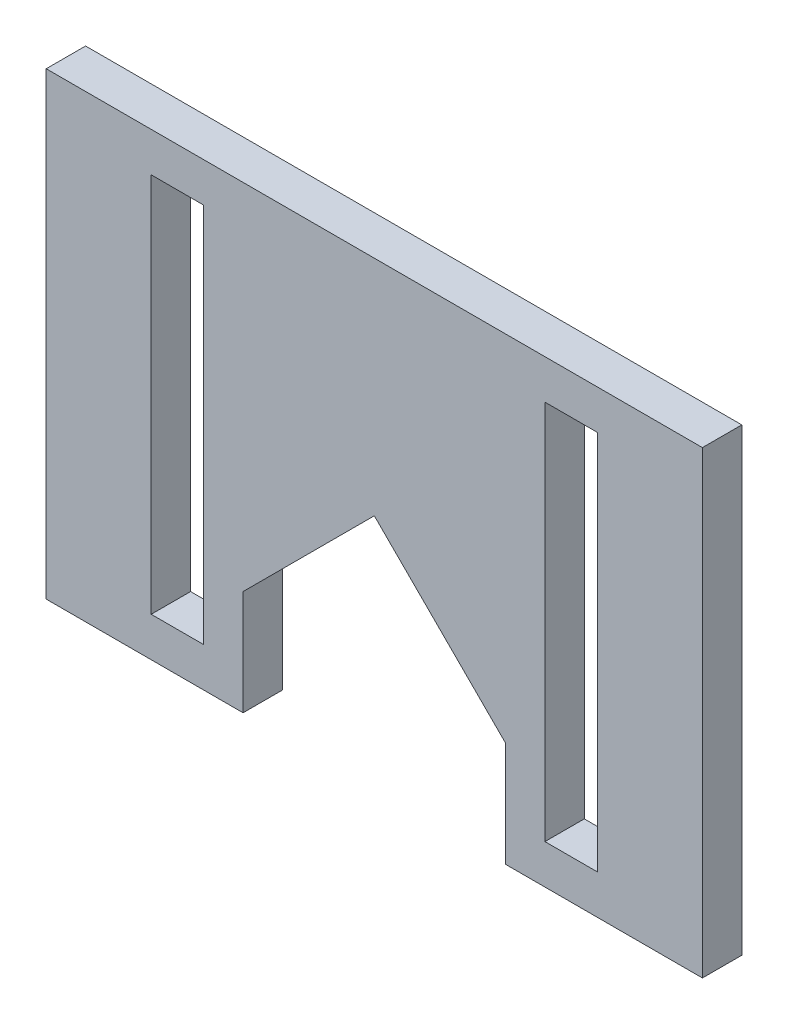
ISO-10303-21;
HEADER;
FILE_DESCRIPTION(('STEP AP214'),'2;1');
FILE_NAME('part.step','',(''),(''),'','','');
FILE_SCHEMA(('AUTOMOTIVE_DESIGN { 1 0 10303 214 1 1 1 1 }'));
ENDSEC;
DATA;
#1=APPLICATION_CONTEXT('core data for automotive mechanical design processes');
#2=APPLICATION_PROTOCOL_DEFINITION('international standard','automotive_design',2000,#1);
#3=PRODUCT_CONTEXT('',#1,'mechanical');
#4=PRODUCT('Part','Part','',(#3));
#5=PRODUCT_RELATED_PRODUCT_CATEGORY('part','',(#4));
#6=PRODUCT_DEFINITION_FORMATION('','',#4);
#7=PRODUCT_DEFINITION_CONTEXT('part definition',#1,'design');
#8=PRODUCT_DEFINITION('design','',#6,#7);
#9=PRODUCT_DEFINITION_SHAPE('','',#8);
#10=(LENGTH_UNIT() NAMED_UNIT(*) SI_UNIT(.MILLI.,.METRE.));
#11=(NAMED_UNIT(*) PLANE_ANGLE_UNIT() SI_UNIT($,.RADIAN.));
#12=(NAMED_UNIT(*) SI_UNIT($,.STERADIAN.) SOLID_ANGLE_UNIT());
#13=UNCERTAINTY_MEASURE_WITH_UNIT(LENGTH_MEASURE(1.E-05),#10,'distance_accuracy_value','');
#14=(GEOMETRIC_REPRESENTATION_CONTEXT(3) GLOBAL_UNCERTAINTY_ASSIGNED_CONTEXT((#13)) GLOBAL_UNIT_ASSIGNED_CONTEXT((#10,
#11,#12)) REPRESENTATION_CONTEXT('',''));
#15=CARTESIAN_POINT('',(0.,0.,0.));
#16=DIRECTION('',(0.,0.,1.));
#17=DIRECTION('',(1.,0.,0.));
#18=AXIS2_PLACEMENT_3D('',#15,#16,#17);
#19=CARTESIAN_POINT('',(0.,0.,3.));
#20=DIRECTION('',(0.,0.,1.));
#21=DIRECTION('',(1.,0.,0.));
#22=AXIS2_PLACEMENT_3D('',#19,#20,#21);
#23=PLANE('',#22);
#24=DIRECTION('',(1.,0.,0.));
#25=VECTOR('',#24,1.);
#26=CARTESIAN_POINT('',(-42.,2.99999999999999,3.));
#27=LINE('',#26,#25);
#28=CARTESIAN_POINT('',(-42.,2.99999999999999,3.));
#29=VERTEX_POINT('',#28);
#30=CARTESIAN_POINT('',(-38.,2.99999999999999,3.));
#31=VERTEX_POINT('',#30);
#32=EDGE_CURVE('E194',#29,#31,#27,.T.);
#33=ORIENTED_EDGE('',*,*,#32,.F.);
#34=DIRECTION('',(0.,-1.,0.));
#35=VECTOR('',#34,1.);
#36=CARTESIAN_POINT('',(-42.,32.,3.));
#37=LINE('',#36,#35);
#38=CARTESIAN_POINT('',(-42.,32.,3.));
#39=VERTEX_POINT('',#38);
#40=EDGE_CURVE('E192',#39,#29,#37,.T.);
#41=ORIENTED_EDGE('',*,*,#40,.F.);
#42=DIRECTION('',(-1.,0.,0.));
#43=VECTOR('',#42,1.);
#44=CARTESIAN_POINT('',(-42.,32.,3.));
#45=LINE('',#44,#43);
#46=CARTESIAN_POINT('',(-38.,32.,3.));
#47=VERTEX_POINT('',#46);
#48=EDGE_CURVE('E200',#47,#39,#45,.T.);
#49=ORIENTED_EDGE('',*,*,#48,.F.);
#50=DIRECTION('',(0.,1.,0.));
#51=VECTOR('',#50,1.);
#52=CARTESIAN_POINT('',(-38.,32.,3.));
#53=LINE('',#52,#51);
#54=EDGE_CURVE('E197',#31,#47,#53,.T.);
#55=ORIENTED_EDGE('',*,*,#54,.F.);
#56=EDGE_LOOP('',(#33,#41,#49,#55));
#57=FACE_BOUND('',#56,.T.);
#58=DIRECTION('',(0.,1.,0.));
#59=VECTOR('',#58,1.);
#60=CARTESIAN_POINT('',(0.,0.,3.));
#61=LINE('',#60,#59);
#62=CARTESIAN_POINT('',(0.,0.,3.));
#63=VERTEX_POINT('',#62);
#64=CARTESIAN_POINT('',(0.,35.,3.));
#65=VERTEX_POINT('',#64);
#66=EDGE_CURVE('E223',#63,#65,#61,.T.);
#67=ORIENTED_EDGE('',*,*,#66,.T.);
#68=DIRECTION('',(-1.,0.,0.));
#69=VECTOR('',#68,1.);
#70=CARTESIAN_POINT('',(0.,35.,3.));
#71=LINE('',#70,#69);
#72=CARTESIAN_POINT('',(-50.,35.,3.));
#73=VERTEX_POINT('',#72);
#74=EDGE_CURVE('E226',#65,#73,#71,.T.);
#75=ORIENTED_EDGE('',*,*,#74,.T.);
#76=DIRECTION('',(0.,-1.,0.));
#77=VECTOR('',#76,1.);
#78=CARTESIAN_POINT('',(-50.,0.,3.));
#79=LINE('',#78,#77);
#80=CARTESIAN_POINT('',(-50.,0.,3.));
#81=VERTEX_POINT('',#80);
#82=EDGE_CURVE('E229',#73,#81,#79,.T.);
#83=ORIENTED_EDGE('',*,*,#82,.T.);
#84=DIRECTION('',(1.,0.,0.));
#85=VECTOR('',#84,1.);
#86=CARTESIAN_POINT('',(-35.,0.,3.));
#87=LINE('',#86,#85);
#88=CARTESIAN_POINT('',(-35.,0.,3.));
#89=VERTEX_POINT('',#88);
#90=EDGE_CURVE('E231',#81,#89,#87,.T.);
#91=ORIENTED_EDGE('',*,*,#90,.T.);
#92=DIRECTION('',(0.,1.,0.));
#93=VECTOR('',#92,1.);
#94=CARTESIAN_POINT('',(-35.,0.,3.));
#95=LINE('',#94,#93);
#96=CARTESIAN_POINT('',(-35.,8.,3.));
#97=VERTEX_POINT('',#96);
#98=EDGE_CURVE('E233',#89,#97,#95,.T.);
#99=ORIENTED_EDGE('',*,*,#98,.T.);
#100=DIRECTION('',(0.707106781186546,0.707106781186549,0.));
#101=VECTOR('',#100,1.);
#102=CARTESIAN_POINT('',(-35.,8.,3.));
#103=LINE('',#102,#101);
#104=CARTESIAN_POINT('',(-25.,18.,3.));
#105=VERTEX_POINT('',#104);
#106=EDGE_CURVE('E235',#97,#105,#103,.T.);
#107=ORIENTED_EDGE('',*,*,#106,.T.);
#108=DIRECTION('',(0.707106781186546,-0.707106781186549,0.));
#109=VECTOR('',#108,1.);
#110=CARTESIAN_POINT('',(-25.,18.,3.));
#111=LINE('',#110,#109);
#112=CARTESIAN_POINT('',(-15.,8.,3.));
#113=VERTEX_POINT('',#112);
#114=EDGE_CURVE('E237',#105,#113,#111,.T.);
#115=ORIENTED_EDGE('',*,*,#114,.T.);
#116=DIRECTION('',(0.,-1.,0.));
#117=VECTOR('',#116,1.);
#118=CARTESIAN_POINT('',(-15.,8.,3.));
#119=LINE('',#118,#117);
#120=CARTESIAN_POINT('',(-15.,0.,3.));
#121=VERTEX_POINT('',#120);
#122=EDGE_CURVE('E239',#113,#121,#119,.T.);
#123=ORIENTED_EDGE('',*,*,#122,.T.);
#124=DIRECTION('',(1.,0.,0.));
#125=VECTOR('',#124,1.);
#126=CARTESIAN_POINT('',(0.,0.,3.));
#127=LINE('',#126,#125);
#128=EDGE_CURVE('E241',#121,#63,#127,.T.);
#129=ORIENTED_EDGE('',*,*,#128,.T.);
#130=EDGE_LOOP('',(#67,#75,#83,#91,#99,#107,#115,#123,#129));
#131=FACE_BOUND('',#130,.T.);
#132=DIRECTION('',(1.,0.,0.));
#133=VECTOR('',#132,1.);
#134=CARTESIAN_POINT('',(-12.,3.,3.));
#135=LINE('',#134,#133);
#136=CARTESIAN_POINT('',(-12.,3.,3.));
#137=VERTEX_POINT('',#136);
#138=CARTESIAN_POINT('',(-8.,3.,3.));
#139=VERTEX_POINT('',#138);
#140=EDGE_CURVE('E164',#137,#139,#135,.T.);
#141=ORIENTED_EDGE('',*,*,#140,.F.);
#142=DIRECTION('',(0.,-1.,0.));
#143=VECTOR('',#142,1.);
#144=CARTESIAN_POINT('',(-12.,32.,3.));
#145=LINE('',#144,#143);
#146=CARTESIAN_POINT('',(-12.,32.,3.));
#147=VERTEX_POINT('',#146);
#148=EDGE_CURVE('E156',#147,#137,#145,.T.);
#149=ORIENTED_EDGE('',*,*,#148,.F.);
#150=DIRECTION('',(-1.,0.,0.));
#151=VECTOR('',#150,1.);
#152=CARTESIAN_POINT('',(-12.,32.,3.));
#153=LINE('',#152,#151);
#154=CARTESIAN_POINT('',(-8.,32.,3.));
#155=VERTEX_POINT('',#154);
#156=EDGE_CURVE('E178',#155,#147,#153,.T.);
#157=ORIENTED_EDGE('',*,*,#156,.F.);
#158=DIRECTION('',(0.,1.,0.));
#159=VECTOR('',#158,1.);
#160=CARTESIAN_POINT('',(-8.,32.,3.));
#161=LINE('',#160,#159);
#162=EDGE_CURVE('E176',#139,#155,#161,.T.);
#163=ORIENTED_EDGE('',*,*,#162,.F.);
#164=EDGE_LOOP('',(#141,#149,#157,#163));
#165=FACE_BOUND('',#164,.T.);
#166=ADVANCED_FACE('F37',(#57,#131,#165),#23,.T.);
#167=CARTESIAN_POINT('',(0.,0.,0.));
#168=DIRECTION('',(0.,0.,1.));
#169=DIRECTION('',(1.,0.,0.));
#170=AXIS2_PLACEMENT_3D('',#167,#168,#169);
#171=PLANE('',#170);
#172=DIRECTION('',(0.,-1.,0.));
#173=VECTOR('',#172,1.);
#174=CARTESIAN_POINT('',(-42.,32.,0.));
#175=LINE('',#174,#173);
#176=CARTESIAN_POINT('',(-42.,32.,0.));
#177=VERTEX_POINT('',#176);
#178=CARTESIAN_POINT('',(-42.,2.99999999999999,0.));
#179=VERTEX_POINT('',#178);
#180=EDGE_CURVE('E172',#177,#179,#175,.T.);
#181=ORIENTED_EDGE('',*,*,#180,.T.);
#182=DIRECTION('',(1.,0.,0.));
#183=VECTOR('',#182,1.);
#184=CARTESIAN_POINT('',(-42.,2.99999999999999,0.));
#185=LINE('',#184,#183);
#186=CARTESIAN_POINT('',(-38.,2.99999999999999,0.));
#187=VERTEX_POINT('',#186);
#188=EDGE_CURVE('E205',#179,#187,#185,.T.);
#189=ORIENTED_EDGE('',*,*,#188,.T.);
#190=DIRECTION('',(0.,1.,0.));
#191=VECTOR('',#190,1.);
#192=CARTESIAN_POINT('',(-38.,32.,0.));
#193=LINE('',#192,#191);
#194=CARTESIAN_POINT('',(-38.,32.,0.));
#195=VERTEX_POINT('',#194);
#196=EDGE_CURVE('E208',#187,#195,#193,.T.);
#197=ORIENTED_EDGE('',*,*,#196,.T.);
#198=DIRECTION('',(-1.,0.,0.));
#199=VECTOR('',#198,1.);
#200=CARTESIAN_POINT('',(-42.,32.,0.));
#201=LINE('',#200,#199);
#202=EDGE_CURVE('E195',#195,#177,#201,.T.);
#203=ORIENTED_EDGE('',*,*,#202,.T.);
#204=EDGE_LOOP('',(#181,#189,#197,#203));
#205=FACE_BOUND('',#204,.T.);
#206=DIRECTION('',(0.,1.,0.));
#207=VECTOR('',#206,1.);
#208=CARTESIAN_POINT('',(0.,0.,0.));
#209=LINE('',#208,#207);
#210=CARTESIAN_POINT('',(0.,0.,0.));
#211=VERTEX_POINT('',#210);
#212=CARTESIAN_POINT('',(0.,35.,0.));
#213=VERTEX_POINT('',#212);
#214=EDGE_CURVE('E222',#211,#213,#209,.T.);
#215=ORIENTED_EDGE('',*,*,#214,.F.);
#216=DIRECTION('',(1.,0.,0.));
#217=VECTOR('',#216,1.);
#218=CARTESIAN_POINT('',(0.,0.,0.));
#219=LINE('',#218,#217);
#220=CARTESIAN_POINT('',(-15.,0.,0.));
#221=VERTEX_POINT('',#220);
#222=EDGE_CURVE('E227',#221,#211,#219,.T.);
#223=ORIENTED_EDGE('',*,*,#222,.F.);
#224=DIRECTION('',(0.,-1.,0.));
#225=VECTOR('',#224,1.);
#226=CARTESIAN_POINT('',(-15.,8.,0.));
#227=LINE('',#226,#225);
#228=CARTESIAN_POINT('',(-15.,8.,0.));
#229=VERTEX_POINT('',#228);
#230=EDGE_CURVE('E258',#229,#221,#227,.T.);
#231=ORIENTED_EDGE('',*,*,#230,.F.);
#232=DIRECTION('',(0.707106781186546,-0.707106781186549,0.));
#233=VECTOR('',#232,1.);
#234=CARTESIAN_POINT('',(-25.,18.,0.));
#235=LINE('',#234,#233);
#236=CARTESIAN_POINT('',(-25.,18.,0.));
#237=VERTEX_POINT('',#236);
#238=EDGE_CURVE('E256',#237,#229,#235,.T.);
#239=ORIENTED_EDGE('',*,*,#238,.F.);
#240=DIRECTION('',(0.707106781186546,0.707106781186549,0.));
#241=VECTOR('',#240,1.);
#242=CARTESIAN_POINT('',(-35.,8.,0.));
#243=LINE('',#242,#241);
#244=CARTESIAN_POINT('',(-35.,8.,0.));
#245=VERTEX_POINT('',#244);
#246=EDGE_CURVE('E254',#245,#237,#243,.T.);
#247=ORIENTED_EDGE('',*,*,#246,.F.);
#248=DIRECTION('',(0.,1.,0.));
#249=VECTOR('',#248,1.);
#250=CARTESIAN_POINT('',(-35.,0.,0.));
#251=LINE('',#250,#249);
#252=CARTESIAN_POINT('',(-35.,0.,0.));
#253=VERTEX_POINT('',#252);
#254=EDGE_CURVE('E252',#253,#245,#251,.T.);
#255=ORIENTED_EDGE('',*,*,#254,.F.);
#256=DIRECTION('',(1.,0.,0.));
#257=VECTOR('',#256,1.);
#258=CARTESIAN_POINT('',(-35.,0.,0.));
#259=LINE('',#258,#257);
#260=CARTESIAN_POINT('',(-50.,0.,0.));
#261=VERTEX_POINT('',#260);
#262=EDGE_CURVE('E250',#261,#253,#259,.T.);
#263=ORIENTED_EDGE('',*,*,#262,.F.);
#264=DIRECTION('',(0.,-1.,0.));
#265=VECTOR('',#264,1.);
#266=CARTESIAN_POINT('',(-50.,0.,0.));
#267=LINE('',#266,#265);
#268=CARTESIAN_POINT('',(-50.,35.,0.));
#269=VERTEX_POINT('',#268);
#270=EDGE_CURVE('E248',#269,#261,#267,.T.);
#271=ORIENTED_EDGE('',*,*,#270,.F.);
#272=DIRECTION('',(-1.,0.,0.));
#273=VECTOR('',#272,1.);
#274=CARTESIAN_POINT('',(0.,35.,0.));
#275=LINE('',#274,#273);
#276=EDGE_CURVE('E246',#213,#269,#275,.T.);
#277=ORIENTED_EDGE('',*,*,#276,.F.);
#278=EDGE_LOOP('',(#215,#223,#231,#239,#247,#255,#263,#271,#277));
#279=FACE_BOUND('',#278,.T.);
#280=DIRECTION('',(0.,-1.,0.));
#281=VECTOR('',#280,1.);
#282=CARTESIAN_POINT('',(-12.,32.,0.));
#283=LINE('',#282,#281);
#284=CARTESIAN_POINT('',(-12.,32.,0.));
#285=VERTEX_POINT('',#284);
#286=CARTESIAN_POINT('',(-12.,3.,0.));
#287=VERTEX_POINT('',#286);
#288=EDGE_CURVE('E60',#285,#287,#283,.T.);
#289=ORIENTED_EDGE('',*,*,#288,.T.);
#290=DIRECTION('',(1.,0.,0.));
#291=VECTOR('',#290,1.);
#292=CARTESIAN_POINT('',(-12.,3.,0.));
#293=LINE('',#292,#291);
#294=CARTESIAN_POINT('',(-8.,3.,0.));
#295=VERTEX_POINT('',#294);
#296=EDGE_CURVE('E171',#287,#295,#293,.T.);
#297=ORIENTED_EDGE('',*,*,#296,.T.);
#298=DIRECTION('',(0.,1.,0.));
#299=VECTOR('',#298,1.);
#300=CARTESIAN_POINT('',(-8.,32.,0.));
#301=LINE('',#300,#299);
#302=CARTESIAN_POINT('',(-8.,32.,0.));
#303=VERTEX_POINT('',#302);
#304=EDGE_CURVE('E184',#295,#303,#301,.T.);
#305=ORIENTED_EDGE('',*,*,#304,.T.);
#306=DIRECTION('',(-1.,0.,0.));
#307=VECTOR('',#306,1.);
#308=CARTESIAN_POINT('',(-12.,32.,0.));
#309=LINE('',#308,#307);
#310=EDGE_CURVE('E165',#303,#285,#309,.T.);
#311=ORIENTED_EDGE('',*,*,#310,.T.);
#312=EDGE_LOOP('',(#289,#297,#305,#311));
#313=FACE_BOUND('',#312,.T.);
#314=ADVANCED_FACE('F291',(#205,#279,#313),#171,.F.);
#315=CARTESIAN_POINT('',(0.,0.,3.));
#316=DIRECTION('',(-1.,0.,0.));
#317=DIRECTION('',(0.,0.,1.));
#318=AXIS2_PLACEMENT_3D('',#315,#316,#317);
#319=PLANE('',#318);
#320=ORIENTED_EDGE('',*,*,#214,.T.);
#321=DIRECTION('',(0.,0.,-1.));
#322=VECTOR('',#321,1.);
#323=CARTESIAN_POINT('',(0.,35.,3.));
#324=LINE('',#323,#322);
#325=EDGE_CURVE('E11',#65,#213,#324,.T.);
#326=ORIENTED_EDGE('',*,*,#325,.F.);
#327=ORIENTED_EDGE('',*,*,#66,.F.);
#328=DIRECTION('',(0.,0.,-1.));
#329=VECTOR('',#328,1.);
#330=CARTESIAN_POINT('',(0.,0.,3.));
#331=LINE('',#330,#329);
#332=EDGE_CURVE('E243',#63,#211,#331,.T.);
#333=ORIENTED_EDGE('',*,*,#332,.T.);
#334=EDGE_LOOP('',(#320,#326,#327,#333));
#335=FACE_BOUND('',#334,.T.);
#336=ADVANCED_FACE('F39',(#335),#319,.F.);
#337=CARTESIAN_POINT('',(0.,35.,3.));
#338=DIRECTION('',(0.,-1.,0.));
#339=DIRECTION('',(1.,0.,0.));
#340=AXIS2_PLACEMENT_3D('',#337,#338,#339);
#341=PLANE('',#340);
#342=ORIENTED_EDGE('',*,*,#276,.T.);
#343=DIRECTION('',(0.,0.,-1.));
#344=VECTOR('',#343,1.);
#345=CARTESIAN_POINT('',(-50.,35.,3.));
#346=LINE('',#345,#344);
#347=EDGE_CURVE('E45',#73,#269,#346,.T.);
#348=ORIENTED_EDGE('',*,*,#347,.F.);
#349=ORIENTED_EDGE('',*,*,#74,.F.);
#350=ORIENTED_EDGE('',*,*,#325,.T.);
#351=EDGE_LOOP('',(#342,#348,#349,#350));
#352=FACE_BOUND('',#351,.T.);
#353=ADVANCED_FACE('F308',(#352),#341,.F.);
#354=CARTESIAN_POINT('',(-50.,0.,3.));
#355=DIRECTION('',(1.,0.,0.));
#356=DIRECTION('',(0.,0.,-1.));
#357=AXIS2_PLACEMENT_3D('',#354,#355,#356);
#358=PLANE('',#357);
#359=ORIENTED_EDGE('',*,*,#270,.T.);
#360=DIRECTION('',(0.,0.,-1.));
#361=VECTOR('',#360,1.);
#362=CARTESIAN_POINT('',(-50.,0.,3.));
#363=LINE('',#362,#361);
#364=EDGE_CURVE('E278',#81,#261,#363,.T.);
#365=ORIENTED_EDGE('',*,*,#364,.F.);
#366=ORIENTED_EDGE('',*,*,#82,.F.);
#367=ORIENTED_EDGE('',*,*,#347,.T.);
#368=EDGE_LOOP('',(#359,#365,#366,#367));
#369=FACE_BOUND('',#368,.T.);
#370=ADVANCED_FACE('F285',(#369),#358,.F.);
#371=CARTESIAN_POINT('',(-35.,0.,3.));
#372=DIRECTION('',(0.,1.,0.));
#373=DIRECTION('',(-1.,0.,0.));
#374=AXIS2_PLACEMENT_3D('',#371,#372,#373);
#375=PLANE('',#374);
#376=ORIENTED_EDGE('',*,*,#262,.T.);
#377=DIRECTION('',(0.,0.,-1.));
#378=VECTOR('',#377,1.);
#379=CARTESIAN_POINT('',(-35.,0.,3.));
#380=LINE('',#379,#378);
#381=EDGE_CURVE('E275',#89,#253,#380,.T.);
#382=ORIENTED_EDGE('',*,*,#381,.F.);
#383=ORIENTED_EDGE('',*,*,#90,.F.);
#384=ORIENTED_EDGE('',*,*,#364,.T.);
#385=EDGE_LOOP('',(#376,#382,#383,#384));
#386=FACE_BOUND('',#385,.T.);
#387=ADVANCED_FACE('F297',(#386),#375,.F.);
#388=CARTESIAN_POINT('',(-35.,0.,3.));
#389=DIRECTION('',(-1.,0.,0.));
#390=DIRECTION('',(0.,0.,1.));
#391=AXIS2_PLACEMENT_3D('',#388,#389,#390);
#392=PLANE('',#391);
#393=ORIENTED_EDGE('',*,*,#254,.T.);
#394=DIRECTION('',(0.,0.,-1.));
#395=VECTOR('',#394,1.);
#396=CARTESIAN_POINT('',(-35.,8.,3.));
#397=LINE('',#396,#395);
#398=EDGE_CURVE('E272',#97,#245,#397,.T.);
#399=ORIENTED_EDGE('',*,*,#398,.F.);
#400=ORIENTED_EDGE('',*,*,#98,.F.);
#401=ORIENTED_EDGE('',*,*,#381,.T.);
#402=EDGE_LOOP('',(#393,#399,#400,#401));
#403=FACE_BOUND('',#402,.T.);
#404=ADVANCED_FACE('F301',(#403),#392,.F.);
#405=CARTESIAN_POINT('',(-35.,8.,3.));
#406=DIRECTION('',(-0.707106781186549,0.707106781186546,0.));
#407=DIRECTION('',(-0.707106781186546,-0.707106781186549,0.));
#408=AXIS2_PLACEMENT_3D('',#405,#406,#407);
#409=PLANE('',#408);
#410=ORIENTED_EDGE('',*,*,#246,.T.);
#411=DIRECTION('',(0.,0.,-1.));
#412=VECTOR('',#411,1.);
#413=CARTESIAN_POINT('',(-25.,18.,3.));
#414=LINE('',#413,#412);
#415=EDGE_CURVE('E269',#105,#237,#414,.T.);
#416=ORIENTED_EDGE('',*,*,#415,.F.);
#417=ORIENTED_EDGE('',*,*,#106,.F.);
#418=ORIENTED_EDGE('',*,*,#398,.T.);
#419=EDGE_LOOP('',(#410,#416,#417,#418));
#420=FACE_BOUND('',#419,.T.);
#421=ADVANCED_FACE('F326',(#420),#409,.F.);
#422=CARTESIAN_POINT('',(-25.,18.,3.));
#423=DIRECTION('',(0.707106781186549,0.707106781186546,0.));
#424=DIRECTION('',(-0.707106781186546,0.707106781186549,0.));
#425=AXIS2_PLACEMENT_3D('',#422,#423,#424);
#426=PLANE('',#425);
#427=ORIENTED_EDGE('',*,*,#238,.T.);
#428=DIRECTION('',(0.,0.,-1.));
#429=VECTOR('',#428,1.);
#430=CARTESIAN_POINT('',(-15.,8.,3.));
#431=LINE('',#430,#429);
#432=EDGE_CURVE('E266',#113,#229,#431,.T.);
#433=ORIENTED_EDGE('',*,*,#432,.F.);
#434=ORIENTED_EDGE('',*,*,#114,.F.);
#435=ORIENTED_EDGE('',*,*,#415,.T.);
#436=EDGE_LOOP('',(#427,#433,#434,#435));
#437=FACE_BOUND('',#436,.T.);
#438=ADVANCED_FACE('F324',(#437),#426,.F.);
#439=CARTESIAN_POINT('',(-15.,8.,3.));
#440=DIRECTION('',(1.,0.,0.));
#441=DIRECTION('',(0.,0.,-1.));
#442=AXIS2_PLACEMENT_3D('',#439,#440,#441);
#443=PLANE('',#442);
#444=ORIENTED_EDGE('',*,*,#230,.T.);
#445=DIRECTION('',(0.,0.,-1.));
#446=VECTOR('',#445,1.);
#447=CARTESIAN_POINT('',(-15.,0.,3.));
#448=LINE('',#447,#446);
#449=EDGE_CURVE('E263',#121,#221,#448,.T.);
#450=ORIENTED_EDGE('',*,*,#449,.F.);
#451=ORIENTED_EDGE('',*,*,#122,.F.);
#452=ORIENTED_EDGE('',*,*,#432,.T.);
#453=EDGE_LOOP('',(#444,#450,#451,#452));
#454=FACE_BOUND('',#453,.T.);
#455=ADVANCED_FACE('F320',(#454),#443,.F.);
#456=CARTESIAN_POINT('',(0.,0.,3.));
#457=DIRECTION('',(0.,1.,0.));
#458=DIRECTION('',(0.,0.,1.));
#459=AXIS2_PLACEMENT_3D('',#456,#457,#458);
#460=PLANE('',#459);
#461=ORIENTED_EDGE('',*,*,#222,.T.);
#462=ORIENTED_EDGE('',*,*,#332,.F.);
#463=ORIENTED_EDGE('',*,*,#128,.F.);
#464=ORIENTED_EDGE('',*,*,#449,.T.);
#465=EDGE_LOOP('',(#461,#462,#463,#464));
#466=FACE_BOUND('',#465,.T.);
#467=ADVANCED_FACE('F315',(#466),#460,.F.);
#468=CARTESIAN_POINT('',(-42.,32.,3.));
#469=DIRECTION('',(1.,0.,0.));
#470=DIRECTION('',(0.,0.,-1.));
#471=AXIS2_PLACEMENT_3D('',#468,#469,#470);
#472=PLANE('',#471);
#473=ORIENTED_EDGE('',*,*,#180,.F.);
#474=DIRECTION('',(0.,0.,-1.));
#475=VECTOR('',#474,1.);
#476=CARTESIAN_POINT('',(-42.,32.,3.));
#477=LINE('',#476,#475);
#478=EDGE_CURVE('E202',#39,#177,#477,.T.);
#479=ORIENTED_EDGE('',*,*,#478,.F.);
#480=ORIENTED_EDGE('',*,*,#40,.T.);
#481=DIRECTION('',(0.,0.,-1.));
#482=VECTOR('',#481,1.);
#483=CARTESIAN_POINT('',(-42.,2.99999999999999,3.));
#484=LINE('',#483,#482);
#485=EDGE_CURVE('E219',#29,#179,#484,.T.);
#486=ORIENTED_EDGE('',*,*,#485,.T.);
#487=EDGE_LOOP('',(#473,#479,#480,#486));
#488=FACE_BOUND('',#487,.T.);
#489=ADVANCED_FACE('F345',(#488),#472,.T.);
#490=CARTESIAN_POINT('',(-42.,2.99999999999999,3.));
#491=DIRECTION('',(0.,1.,0.));
#492=DIRECTION('',(-1.,0.,0.));
#493=AXIS2_PLACEMENT_3D('',#490,#491,#492);
#494=PLANE('',#493);
#495=ORIENTED_EDGE('',*,*,#188,.F.);
#496=ORIENTED_EDGE('',*,*,#485,.F.);
#497=ORIENTED_EDGE('',*,*,#32,.T.);
#498=DIRECTION('',(0.,0.,-1.));
#499=VECTOR('',#498,1.);
#500=CARTESIAN_POINT('',(-38.,2.99999999999999,3.));
#501=LINE('',#500,#499);
#502=EDGE_CURVE('E217',#31,#187,#501,.T.);
#503=ORIENTED_EDGE('',*,*,#502,.T.);
#504=EDGE_LOOP('',(#495,#496,#497,#503));
#505=FACE_BOUND('',#504,.T.);
#506=ADVANCED_FACE('F365',(#505),#494,.T.);
#507=CARTESIAN_POINT('',(-38.,32.,3.));
#508=DIRECTION('',(-1.,0.,0.));
#509=DIRECTION('',(0.,0.,1.));
#510=AXIS2_PLACEMENT_3D('',#507,#508,#509);
#511=PLANE('',#510);
#512=ORIENTED_EDGE('',*,*,#196,.F.);
#513=ORIENTED_EDGE('',*,*,#502,.F.);
#514=ORIENTED_EDGE('',*,*,#54,.T.);
#515=DIRECTION('',(0.,0.,-1.));
#516=VECTOR('',#515,1.);
#517=CARTESIAN_POINT('',(-38.,32.,3.));
#518=LINE('',#517,#516);
#519=EDGE_CURVE('E215',#47,#195,#518,.T.);
#520=ORIENTED_EDGE('',*,*,#519,.T.);
#521=EDGE_LOOP('',(#512,#513,#514,#520));
#522=FACE_BOUND('',#521,.T.);
#523=ADVANCED_FACE('F372',(#522),#511,.T.);
#524=CARTESIAN_POINT('',(-42.,32.,3.));
#525=DIRECTION('',(0.,-1.,0.));
#526=DIRECTION('',(0.,0.,-1.));
#527=AXIS2_PLACEMENT_3D('',#524,#525,#526);
#528=PLANE('',#527);
#529=ORIENTED_EDGE('',*,*,#202,.F.);
#530=ORIENTED_EDGE('',*,*,#519,.F.);
#531=ORIENTED_EDGE('',*,*,#48,.T.);
#532=ORIENTED_EDGE('',*,*,#478,.T.);
#533=EDGE_LOOP('',(#529,#530,#531,#532));
#534=FACE_BOUND('',#533,.T.);
#535=ADVANCED_FACE('F379',(#534),#528,.T.);
#536=CARTESIAN_POINT('',(-12.,32.,3.));
#537=DIRECTION('',(1.,0.,0.));
#538=DIRECTION('',(0.,1.,0.));
#539=AXIS2_PLACEMENT_3D('',#536,#537,#538);
#540=PLANE('',#539);
#541=ORIENTED_EDGE('',*,*,#288,.F.);
#542=DIRECTION('',(0.,0.,-1.));
#543=VECTOR('',#542,1.);
#544=CARTESIAN_POINT('',(-12.,32.,3.));
#545=LINE('',#544,#543);
#546=EDGE_CURVE('E160',#147,#285,#545,.T.);
#547=ORIENTED_EDGE('',*,*,#546,.F.);
#548=ORIENTED_EDGE('',*,*,#148,.T.);
#549=DIRECTION('',(0.,0.,-1.));
#550=VECTOR('',#549,1.);
#551=CARTESIAN_POINT('',(-12.,3.,3.));
#552=LINE('',#551,#550);
#553=EDGE_CURVE('E159',#137,#287,#552,.T.);
#554=ORIENTED_EDGE('',*,*,#553,.T.);
#555=EDGE_LOOP('',(#541,#547,#548,#554));
#556=FACE_BOUND('',#555,.T.);
#557=ADVANCED_FACE('F158',(#556),#540,.T.);
#558=CARTESIAN_POINT('',(-12.,3.,3.));
#559=DIRECTION('',(0.,1.,0.));
#560=DIRECTION('',(-1.,0.,0.));
#561=AXIS2_PLACEMENT_3D('',#558,#559,#560);
#562=PLANE('',#561);
#563=ORIENTED_EDGE('',*,*,#296,.F.);
#564=ORIENTED_EDGE('',*,*,#553,.F.);
#565=ORIENTED_EDGE('',*,*,#140,.T.);
#566=DIRECTION('',(0.,0.,-1.));
#567=VECTOR('',#566,1.);
#568=CARTESIAN_POINT('',(-8.,3.,3.));
#569=LINE('',#568,#567);
#570=EDGE_CURVE('E173',#139,#295,#569,.T.);
#571=ORIENTED_EDGE('',*,*,#570,.T.);
#572=EDGE_LOOP('',(#563,#564,#565,#571));
#573=FACE_BOUND('',#572,.T.);
#574=ADVANCED_FACE('F168',(#573),#562,.T.);
#575=CARTESIAN_POINT('',(-8.,32.,3.));
#576=DIRECTION('',(-1.,0.,0.));
#577=DIRECTION('',(0.,-1.,0.));
#578=AXIS2_PLACEMENT_3D('',#575,#576,#577);
#579=PLANE('',#578);
#580=ORIENTED_EDGE('',*,*,#304,.F.);
#581=ORIENTED_EDGE('',*,*,#570,.F.);
#582=ORIENTED_EDGE('',*,*,#162,.T.);
#583=DIRECTION('',(0.,0.,-1.));
#584=VECTOR('',#583,1.);
#585=CARTESIAN_POINT('',(-8.,32.,3.));
#586=LINE('',#585,#584);
#587=EDGE_CURVE('E52',#155,#303,#586,.T.);
#588=ORIENTED_EDGE('',*,*,#587,.T.);
#589=EDGE_LOOP('',(#580,#581,#582,#588));
#590=FACE_BOUND('',#589,.T.);
#591=ADVANCED_FACE('F400',(#590),#579,.T.);
#592=CARTESIAN_POINT('',(-12.,32.,3.));
#593=DIRECTION('',(0.,-1.,0.));
#594=DIRECTION('',(0.,0.,-1.));
#595=AXIS2_PLACEMENT_3D('',#592,#593,#594);
#596=PLANE('',#595);
#597=ORIENTED_EDGE('',*,*,#310,.F.);
#598=ORIENTED_EDGE('',*,*,#587,.F.);
#599=ORIENTED_EDGE('',*,*,#156,.T.);
#600=ORIENTED_EDGE('',*,*,#546,.T.);
#601=EDGE_LOOP('',(#597,#598,#599,#600));
#602=FACE_BOUND('',#601,.T.);
#603=ADVANCED_FACE('F407',(#602),#596,.T.);
#604=CLOSED_SHELL('',(#166,#314,#336,#353,#370,#387,#404,#421,#438,#455,#467,#489,#506,#523,
#535,#557,#574,#591,#603));
#605=MANIFOLD_SOLID_BREP('B2',#604);
#606=ADVANCED_BREP_SHAPE_REPRESENTATION('',(#18,#605),#14);
#607=SHAPE_DEFINITION_REPRESENTATION(#9,#606);
ENDSEC;
END-ISO-10303-21;
